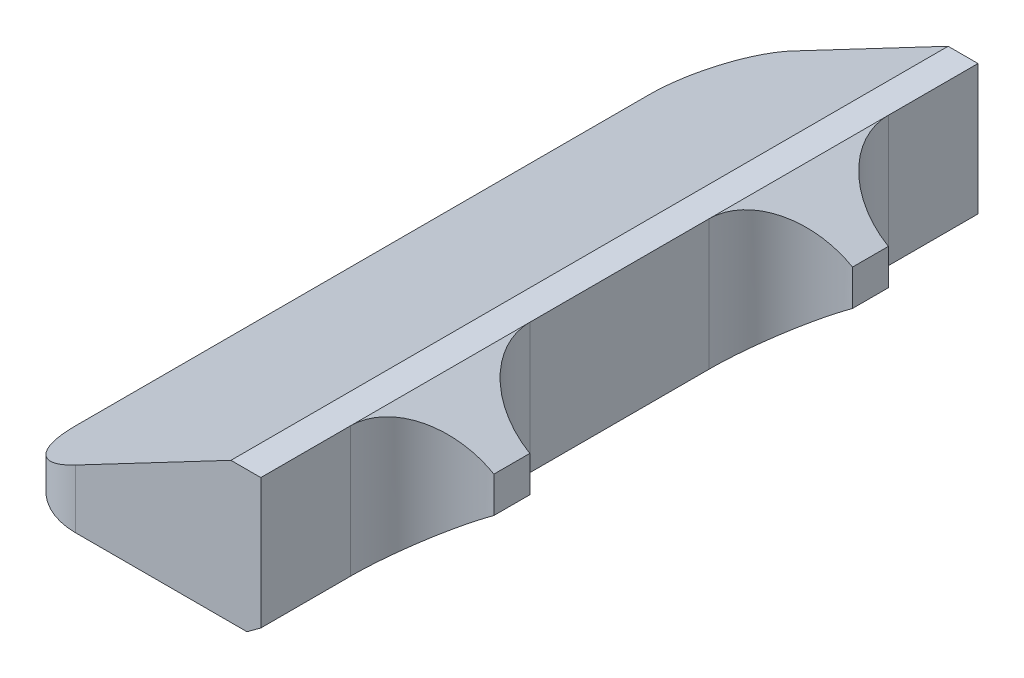
ISO-10303-21;
HEADER;
FILE_DESCRIPTION(('STEP AP214'),'2;1');
FILE_NAME('part.step','',(''),(''),'','','');
FILE_SCHEMA(('AUTOMOTIVE_DESIGN { 1 0 10303 214 1 1 1 1 }'));
ENDSEC;
DATA;
#1=APPLICATION_CONTEXT('core data for automotive mechanical design processes');
#2=APPLICATION_PROTOCOL_DEFINITION('international standard','automotive_design',2000,#1);
#3=PRODUCT_CONTEXT('',#1,'mechanical');
#4=PRODUCT('Part','Part','',(#3));
#5=PRODUCT_RELATED_PRODUCT_CATEGORY('part','',(#4));
#6=PRODUCT_DEFINITION_FORMATION('','',#4);
#7=PRODUCT_DEFINITION_CONTEXT('part definition',#1,'design');
#8=PRODUCT_DEFINITION('design','',#6,#7);
#9=PRODUCT_DEFINITION_SHAPE('','',#8);
#10=(LENGTH_UNIT() NAMED_UNIT(*) SI_UNIT(.MILLI.,.METRE.));
#11=(NAMED_UNIT(*) PLANE_ANGLE_UNIT() SI_UNIT($,.RADIAN.));
#12=(NAMED_UNIT(*) SI_UNIT($,.STERADIAN.) SOLID_ANGLE_UNIT());
#13=UNCERTAINTY_MEASURE_WITH_UNIT(LENGTH_MEASURE(1.E-05),#10,'distance_accuracy_value','');
#14=(GEOMETRIC_REPRESENTATION_CONTEXT(3) GLOBAL_UNCERTAINTY_ASSIGNED_CONTEXT((#13)) GLOBAL_UNIT_ASSIGNED_CONTEXT((#10,
#11,#12)) REPRESENTATION_CONTEXT('',''));
#15=CARTESIAN_POINT('',(0.,0.,0.));
#16=DIRECTION('',(0.,0.,1.));
#17=DIRECTION('',(1.,0.,0.));
#18=AXIS2_PLACEMENT_3D('',#15,#16,#17);
#19=CARTESIAN_POINT('',(20.,0.,60.));
#20=DIRECTION('',(-0.591363663627517,0.806404995855705,0.));
#21=DIRECTION('',(-0.806404995855706,-0.591363663627517,0.));
#22=AXIS2_PLACEMENT_3D('',#19,#20,#21);
#23=PLANE('',#22);
#24=DIRECTION('',(0.,0.,-1.));
#25=VECTOR('',#24,1.);
#26=CARTESIAN_POINT('',(20.,0.,60.));
#27=LINE('',#26,#25);
#28=CARTESIAN_POINT('',(20.,0.,59.75));
#29=VERTEX_POINT('',#28);
#30=CARTESIAN_POINT('',(20.,0.,0.24999999999999));
#31=VERTEX_POINT('',#30);
#32=EDGE_CURVE('E214',#29,#31,#27,.T.);
#33=ORIENTED_EDGE('',*,*,#32,.T.);
#34=DIRECTION('',(-0.694117220074126,-0.509019294721026,0.509019294721012));
#35=VECTOR('',#34,1.);
#36=CARTESIAN_POINT('',(10.3640256959313,-7.06638115631702,7.31638115631682));
#37=LINE('',#36,#35);
#38=CARTESIAN_POINT('',(20.3409090909091,0.25,0.));
#39=VERTEX_POINT('',#38);
#40=EDGE_CURVE('E242',#31,#39,#37,.F.);
#41=ORIENTED_EDGE('',*,*,#40,.T.);
#42=DIRECTION('',(0.806404995855706,0.591363663627517,0.));
#43=VECTOR('',#42,1.);
#44=CARTESIAN_POINT('',(20.,0.,0.));
#45=LINE('',#44,#43);
#46=CARTESIAN_POINT('',(21.5,1.1,0.));
#47=VERTEX_POINT('',#46);
#48=EDGE_CURVE('E295',#39,#47,#45,.T.);
#49=ORIENTED_EDGE('',*,*,#48,.T.);
#50=DIRECTION('',(0.,0.,-1.));
#51=VECTOR('',#50,1.);
#52=CARTESIAN_POINT('',(21.5,1.10000000000004,60.));
#53=LINE('',#52,#51);
#54=CARTESIAN_POINT('',(21.5,1.1,7.5));
#55=VERTEX_POINT('',#54);
#56=EDGE_CURVE('E353',#55,#47,#53,.T.);
#57=ORIENTED_EDGE('',*,*,#56,.F.);
#58=CARTESIAN_POINT('',(27.5,5.5,7.49999999999999));
#59=DIRECTION('',(-0.591363663627517,0.806404995855705,0.));
#60=DIRECTION('',(-0.806404995855706,-0.591363663627517,0.));
#61=AXIS2_PLACEMENT_3D('',#58,#59,#60);
#62=ELLIPSE('',#61,7.44043009509531,6.);
#63=CARTESIAN_POINT('',(27.5,5.5,13.5));
#64=VERTEX_POINT('',#63);
#65=EDGE_CURVE('E290',#64,#55,#62,.F.);
#66=ORIENTED_EDGE('',*,*,#65,.F.);
#67=DIRECTION('',(0.,0.,-1.));
#68=VECTOR('',#67,1.);
#69=CARTESIAN_POINT('',(27.5,5.5,60.));
#70=LINE('',#69,#68);
#71=CARTESIAN_POINT('',(27.5,5.5,16.5));
#72=VERTEX_POINT('',#71);
#73=EDGE_CURVE('E210',#72,#64,#70,.T.);
#74=ORIENTED_EDGE('',*,*,#73,.F.);
#75=CARTESIAN_POINT('',(27.5,5.5,22.5));
#76=DIRECTION('',(-0.591363663627517,0.806404995855705,0.));
#77=DIRECTION('',(-0.806404995855706,-0.591363663627517,0.));
#78=AXIS2_PLACEMENT_3D('',#75,#76,#77);
#79=ELLIPSE('',#78,7.44043009509531,6.);
#80=CARTESIAN_POINT('',(21.5,1.1,22.5));
#81=VERTEX_POINT('',#80);
#82=EDGE_CURVE('E364',#81,#72,#79,.F.);
#83=ORIENTED_EDGE('',*,*,#82,.F.);
#84=DIRECTION('',(0.,0.,-1.));
#85=VECTOR('',#84,1.);
#86=CARTESIAN_POINT('',(21.5,1.1,60.));
#87=LINE('',#86,#85);
#88=CARTESIAN_POINT('',(21.5,1.1,37.5));
#89=VERTEX_POINT('',#88);
#90=EDGE_CURVE('E360',#89,#81,#87,.T.);
#91=ORIENTED_EDGE('',*,*,#90,.F.);
#92=CARTESIAN_POINT('',(27.5,5.5,37.5));
#93=DIRECTION('',(-0.591363663627517,0.806404995855705,0.));
#94=DIRECTION('',(-0.806404995855706,-0.591363663627517,0.));
#95=AXIS2_PLACEMENT_3D('',#92,#93,#94);
#96=ELLIPSE('',#95,7.4404300950953,5.99999999999999);
#97=CARTESIAN_POINT('',(27.5,5.5,43.5));
#98=VERTEX_POINT('',#97);
#99=EDGE_CURVE('E184',#98,#89,#96,.F.);
#100=ORIENTED_EDGE('',*,*,#99,.F.);
#101=CARTESIAN_POINT('',(27.5,5.5,46.5));
#102=VERTEX_POINT('',#101);
#103=EDGE_CURVE('E213',#102,#98,#70,.T.);
#104=ORIENTED_EDGE('',*,*,#103,.F.);
#105=CARTESIAN_POINT('',(27.5,5.5,52.5));
#106=DIRECTION('',(-0.591363663627517,0.806404995855705,0.));
#107=DIRECTION('',(-0.806404995855706,-0.591363663627517,0.));
#108=AXIS2_PLACEMENT_3D('',#105,#106,#107);
#109=ELLIPSE('',#108,7.44043009509531,6.);
#110=CARTESIAN_POINT('',(21.5,1.1,52.5));
#111=VERTEX_POINT('',#110);
#112=EDGE_CURVE('E196',#111,#102,#109,.F.);
#113=ORIENTED_EDGE('',*,*,#112,.F.);
#114=DIRECTION('',(0.,0.,-1.));
#115=VECTOR('',#114,1.);
#116=CARTESIAN_POINT('',(21.5,1.1,60.));
#117=LINE('',#116,#115);
#118=CARTESIAN_POINT('',(21.5,1.1,60.));
#119=VERTEX_POINT('',#118);
#120=EDGE_CURVE('E280',#119,#111,#117,.T.);
#121=ORIENTED_EDGE('',*,*,#120,.F.);
#122=DIRECTION('',(0.806404995855706,0.591363663627517,0.));
#123=VECTOR('',#122,1.);
#124=CARTESIAN_POINT('',(20.,0.,60.));
#125=LINE('',#124,#123);
#126=CARTESIAN_POINT('',(20.3409090909091,0.249999999999994,60.));
#127=VERTEX_POINT('',#126);
#128=EDGE_CURVE('E273',#127,#119,#125,.T.);
#129=ORIENTED_EDGE('',*,*,#128,.F.);
#130=DIRECTION('',(-0.694117220074126,-0.509019294721026,-0.509019294721012));
#131=VECTOR('',#130,1.);
#132=CARTESIAN_POINT('',(10.5406852248393,-6.93683083511788,52.8131691648823));
#133=LINE('',#132,#131);
#134=EDGE_CURVE('E240',#127,#29,#133,.T.);
#135=ORIENTED_EDGE('',*,*,#134,.T.);
#136=EDGE_LOOP('',(#33,#41,#49,#57,#66,#74,#83,#91,#100,#104,#113,#121,#129,#135));
#137=FACE_BOUND('',#136,.T.);
#138=ADVANCED_FACE('F32',(#137),#23,.F.);
#139=CARTESIAN_POINT('',(27.5,5.5,60.));
#140=DIRECTION('',(-1.,0.,0.));
#141=DIRECTION('',(0.,0.,1.));
#142=AXIS2_PLACEMENT_3D('',#139,#140,#141);
#143=PLANE('',#142);
#144=DIRECTION('',(0.,-1.,0.));
#145=VECTOR('',#144,1.);
#146=CARTESIAN_POINT('',(27.5,12.,13.5));
#147=LINE('',#146,#145);
#148=CARTESIAN_POINT('',(27.5,8.5,13.5));
#149=VERTEX_POINT('',#148);
#150=EDGE_CURVE('E351',#149,#64,#147,.T.);
#151=ORIENTED_EDGE('',*,*,#150,.F.);
#152=DIRECTION('',(0.,0.,-1.));
#153=VECTOR('',#152,1.);
#154=CARTESIAN_POINT('',(27.5,8.5,60.));
#155=LINE('',#154,#153);
#156=CARTESIAN_POINT('',(27.5,8.5,16.5));
#157=VERTEX_POINT('',#156);
#158=EDGE_CURVE('E203',#157,#149,#155,.T.);
#159=ORIENTED_EDGE('',*,*,#158,.F.);
#160=DIRECTION('',(0.,-1.,0.));
#161=VECTOR('',#160,1.);
#162=CARTESIAN_POINT('',(27.5,12.,16.5));
#163=LINE('',#162,#161);
#164=EDGE_CURVE('E348',#157,#72,#163,.T.);
#165=ORIENTED_EDGE('',*,*,#164,.T.);
#166=ORIENTED_EDGE('',*,*,#73,.T.);
#167=EDGE_LOOP('',(#151,#159,#165,#166));
#168=FACE_BOUND('',#167,.T.);
#169=ADVANCED_FACE('F380',(#168),#143,.F.);
#170=DIRECTION('',(0.,-1.,0.));
#171=VECTOR('',#170,1.);
#172=CARTESIAN_POINT('',(27.5,12.,43.5));
#173=LINE('',#172,#171);
#174=CARTESIAN_POINT('',(27.5,8.5,43.5));
#175=VERTEX_POINT('',#174);
#176=EDGE_CURVE('E185',#175,#98,#173,.T.);
#177=ORIENTED_EDGE('',*,*,#176,.F.);
#178=CARTESIAN_POINT('',(27.5,8.5,46.5));
#179=VERTEX_POINT('',#178);
#180=EDGE_CURVE('E195',#179,#175,#155,.T.);
#181=ORIENTED_EDGE('',*,*,#180,.F.);
#182=DIRECTION('',(0.,-1.,0.));
#183=VECTOR('',#182,1.);
#184=CARTESIAN_POINT('',(27.5,12.,46.5));
#185=LINE('',#184,#183);
#186=EDGE_CURVE('E343',#179,#102,#185,.T.);
#187=ORIENTED_EDGE('',*,*,#186,.T.);
#188=ORIENTED_EDGE('',*,*,#103,.T.);
#189=EDGE_LOOP('',(#177,#181,#187,#188));
#190=FACE_BOUND('',#189,.T.);
#191=ADVANCED_FACE('F401',(#190),#143,.F.);
#192=CARTESIAN_POINT('',(21.5,12.,60.));
#193=DIRECTION('',(-0.503871025524086,-0.863778900898434,0.));
#194=DIRECTION('',(0.863778900898434,-0.503871025524086,0.));
#195=AXIS2_PLACEMENT_3D('',#192,#193,#194);
#196=PLANE('',#195);
#197=CARTESIAN_POINT('',(27.5,8.5,7.49999999999999));
#198=DIRECTION('',(-0.503871025524086,-0.863778900898434,0.));
#199=DIRECTION('',(0.863778900898434,-0.503871025524086,0.));
#200=AXIS2_PLACEMENT_3D('',#197,#198,#199);
#201=ELLIPSE('',#200,6.9462219947249,6.);
#202=CARTESIAN_POINT('',(21.5,12.,7.5));
#203=VERTEX_POINT('',#202);
#204=EDGE_CURVE('E365',#203,#149,#201,.F.);
#205=ORIENTED_EDGE('',*,*,#204,.F.);
#206=DIRECTION('',(0.,0.,-1.));
#207=VECTOR('',#206,1.);
#208=CARTESIAN_POINT('',(21.5,12.,60.));
#209=LINE('',#208,#207);
#210=CARTESIAN_POINT('',(21.5,12.,22.5));
#211=VERTEX_POINT('',#210);
#212=EDGE_CURVE('E201',#211,#203,#209,.T.);
#213=ORIENTED_EDGE('',*,*,#212,.F.);
#214=CARTESIAN_POINT('',(27.5,8.5,22.5));
#215=DIRECTION('',(-0.503871025524086,-0.863778900898434,0.));
#216=DIRECTION('',(0.863778900898434,-0.503871025524086,0.));
#217=AXIS2_PLACEMENT_3D('',#214,#215,#216);
#218=ELLIPSE('',#217,6.9462219947249,6.);
#219=EDGE_CURVE('E362',#157,#211,#218,.F.);
#220=ORIENTED_EDGE('',*,*,#219,.F.);
#221=ORIENTED_EDGE('',*,*,#158,.T.);
#222=EDGE_LOOP('',(#205,#213,#220,#221));
#223=FACE_BOUND('',#222,.T.);
#224=ADVANCED_FACE('F377',(#223),#196,.F.);
#225=CARTESIAN_POINT('',(27.5,8.5,37.5));
#226=DIRECTION('',(-0.503871025524086,-0.863778900898434,0.));
#227=DIRECTION('',(0.863778900898434,-0.503871025524086,0.));
#228=AXIS2_PLACEMENT_3D('',#225,#226,#227);
#229=ELLIPSE('',#228,6.94622199472489,5.99999999999999);
#230=CARTESIAN_POINT('',(21.5,12.,37.5));
#231=VERTEX_POINT('',#230);
#232=EDGE_CURVE('E181',#231,#175,#229,.F.);
#233=ORIENTED_EDGE('',*,*,#232,.F.);
#234=CARTESIAN_POINT('',(21.5,12.,52.5));
#235=VERTEX_POINT('',#234);
#236=EDGE_CURVE('E192',#235,#231,#209,.T.);
#237=ORIENTED_EDGE('',*,*,#236,.F.);
#238=CARTESIAN_POINT('',(27.5,8.5,52.5));
#239=DIRECTION('',(-0.503871025524086,-0.863778900898434,0.));
#240=DIRECTION('',(0.863778900898434,-0.503871025524086,0.));
#241=AXIS2_PLACEMENT_3D('',#238,#239,#240);
#242=ELLIPSE('',#241,6.9462219947249,6.);
#243=EDGE_CURVE('E356',#179,#235,#242,.F.);
#244=ORIENTED_EDGE('',*,*,#243,.F.);
#245=ORIENTED_EDGE('',*,*,#180,.T.);
#246=EDGE_LOOP('',(#233,#237,#244,#245));
#247=FACE_BOUND('',#246,.T.);
#248=ADVANCED_FACE('F190',(#247),#196,.F.);
#249=CARTESIAN_POINT('',(0.,0.,60.));
#250=DIRECTION('',(0.,0.,1.));
#251=DIRECTION('',(1.,0.,0.));
#252=AXIS2_PLACEMENT_3D('',#249,#250,#251);
#253=PLANE('',#252);
#254=DIRECTION('',(0.,-1.,0.));
#255=VECTOR('',#254,1.);
#256=CARTESIAN_POINT('',(6.,0.,60.));
#257=LINE('',#256,#255);
#258=CARTESIAN_POINT('',(6.,5.15789473684211,60.));
#259=VERTEX_POINT('',#258);
#260=CARTESIAN_POINT('',(6.,0.25,60.));
#261=VERTEX_POINT('',#260);
#262=EDGE_CURVE('E227',#259,#261,#257,.T.);
#263=ORIENTED_EDGE('',*,*,#262,.T.);
#264=DIRECTION('',(1.,0.,0.));
#265=VECTOR('',#264,1.);
#266=CARTESIAN_POINT('',(20.,0.25,60.));
#267=LINE('',#266,#265);
#268=EDGE_CURVE('E11',#261,#127,#267,.T.);
#269=ORIENTED_EDGE('',*,*,#268,.T.);
#270=ORIENTED_EDGE('',*,*,#128,.T.);
#271=DIRECTION('',(0.,-1.,0.));
#272=VECTOR('',#271,1.);
#273=CARTESIAN_POINT('',(21.5,12.,60.));
#274=LINE('',#273,#272);
#275=CARTESIAN_POINT('',(21.5,12.,60.));
#276=VERTEX_POINT('',#275);
#277=EDGE_CURVE('E332',#276,#119,#274,.T.);
#278=ORIENTED_EDGE('',*,*,#277,.F.);
#279=DIRECTION('',(-1.,0.,0.));
#280=VECTOR('',#279,1.);
#281=CARTESIAN_POINT('',(19.,12.,60.));
#282=LINE('',#281,#280);
#283=CARTESIAN_POINT('',(19.,12.,60.));
#284=VERTEX_POINT('',#283);
#285=EDGE_CURVE('E281',#276,#284,#282,.T.);
#286=ORIENTED_EDGE('',*,*,#285,.T.);
#287=DIRECTION('',(-0.884918222381982,-0.465746432832622,0.));
#288=VECTOR('',#287,1.);
#289=CARTESIAN_POINT('',(19.,12.,60.));
#290=LINE('',#289,#288);
#291=EDGE_CURVE('E284',#284,#259,#290,.T.);
#292=ORIENTED_EDGE('',*,*,#291,.T.);
#293=EDGE_LOOP('',(#263,#269,#270,#278,#286,#292));
#294=FACE_BOUND('',#293,.T.);
#295=ADVANCED_FACE('F271',(#294),#253,.T.);
#296=CARTESIAN_POINT('',(0.,0.,0.));
#297=DIRECTION('',(0.,0.,1.));
#298=DIRECTION('',(1.,0.,0.));
#299=AXIS2_PLACEMENT_3D('',#296,#297,#298);
#300=PLANE('',#299);
#301=ORIENTED_EDGE('',*,*,#48,.F.);
#302=DIRECTION('',(-1.,0.,0.));
#303=VECTOR('',#302,1.);
#304=CARTESIAN_POINT('',(0.,0.25,0.));
#305=LINE('',#304,#303);
#306=CARTESIAN_POINT('',(6.,0.25,0.));
#307=VERTEX_POINT('',#306);
#308=EDGE_CURVE('E244',#39,#307,#305,.T.);
#309=ORIENTED_EDGE('',*,*,#308,.T.);
#310=DIRECTION('',(0.,-1.,0.));
#311=VECTOR('',#310,1.);
#312=CARTESIAN_POINT('',(6.,0.,0.));
#313=LINE('',#312,#311);
#314=CARTESIAN_POINT('',(6.,5.15789473684211,0.));
#315=VERTEX_POINT('',#314);
#316=EDGE_CURVE('E221',#307,#315,#313,.F.);
#317=ORIENTED_EDGE('',*,*,#316,.T.);
#318=DIRECTION('',(-0.884918222381982,-0.465746432832622,0.));
#319=VECTOR('',#318,1.);
#320=CARTESIAN_POINT('',(19.,12.,0.));
#321=LINE('',#320,#319);
#322=CARTESIAN_POINT('',(19.,12.,0.));
#323=VERTEX_POINT('',#322);
#324=EDGE_CURVE('E282',#323,#315,#321,.T.);
#325=ORIENTED_EDGE('',*,*,#324,.F.);
#326=DIRECTION('',(-1.,0.,0.));
#327=VECTOR('',#326,1.);
#328=CARTESIAN_POINT('',(19.,12.,0.));
#329=LINE('',#328,#327);
#330=CARTESIAN_POINT('',(21.5,12.,0.));
#331=VERTEX_POINT('',#330);
#332=EDGE_CURVE('E287',#331,#323,#329,.T.);
#333=ORIENTED_EDGE('',*,*,#332,.F.);
#334=DIRECTION('',(0.,-1.,0.));
#335=VECTOR('',#334,1.);
#336=CARTESIAN_POINT('',(21.5,12.,0.));
#337=LINE('',#336,#335);
#338=EDGE_CURVE('E329',#331,#47,#337,.T.);
#339=ORIENTED_EDGE('',*,*,#338,.T.);
#340=EDGE_LOOP('',(#301,#309,#317,#325,#333,#339));
#341=FACE_BOUND('',#340,.T.);
#342=ADVANCED_FACE('F310',(#341),#300,.F.);
#343=CARTESIAN_POINT('',(0.,2.,60.));
#344=DIRECTION('',(1.,0.,0.));
#345=DIRECTION('',(0.,1.,0.));
#346=AXIS2_PLACEMENT_3D('',#343,#344,#345);
#347=PLANE('',#346);
#348=DIRECTION('',(0.,-1.,0.));
#349=VECTOR('',#348,1.);
#350=CARTESIAN_POINT('',(0.,2.,6.));
#351=LINE('',#350,#349);
#352=CARTESIAN_POINT('',(0.,2.,6.));
#353=VERTEX_POINT('',#352);
#354=CARTESIAN_POINT('',(0.,0.25,6.));
#355=VERTEX_POINT('',#354);
#356=EDGE_CURVE('E219',#353,#355,#351,.T.);
#357=ORIENTED_EDGE('',*,*,#356,.T.);
#358=DIRECTION('',(0.,0.,1.));
#359=VECTOR('',#358,1.);
#360=CARTESIAN_POINT('',(0.,0.25,60.));
#361=LINE('',#360,#359);
#362=CARTESIAN_POINT('',(0.,0.25,54.));
#363=VERTEX_POINT('',#362);
#364=EDGE_CURVE('E56',#355,#363,#361,.T.);
#365=ORIENTED_EDGE('',*,*,#364,.T.);
#366=DIRECTION('',(0.,-1.,0.));
#367=VECTOR('',#366,1.);
#368=CARTESIAN_POINT('',(0.,2.,54.));
#369=LINE('',#368,#367);
#370=CARTESIAN_POINT('',(0.,2.,54.));
#371=VERTEX_POINT('',#370);
#372=EDGE_CURVE('E217',#363,#371,#369,.F.);
#373=ORIENTED_EDGE('',*,*,#372,.T.);
#374=DIRECTION('',(0.,0.,-1.));
#375=VECTOR('',#374,1.);
#376=CARTESIAN_POINT('',(0.,2.,60.));
#377=LINE('',#376,#375);
#378=EDGE_CURVE('E294',#371,#353,#377,.T.);
#379=ORIENTED_EDGE('',*,*,#378,.T.);
#380=EDGE_LOOP('',(#357,#365,#373,#379));
#381=FACE_BOUND('',#380,.T.);
#382=ADVANCED_FACE('F407',(#381),#347,.F.);
#383=CARTESIAN_POINT('',(0.,0.,60.));
#384=DIRECTION('',(0.,1.,0.));
#385=DIRECTION('',(0.,0.,1.));
#386=AXIS2_PLACEMENT_3D('',#383,#384,#385);
#387=PLANE('',#386);
#388=CARTESIAN_POINT('',(6.,0.,6.));
#389=DIRECTION('',(0.,1.,0.));
#390=DIRECTION('',(0.,0.,1.));
#391=AXIS2_PLACEMENT_3D('',#388,#389,#390);
#392=CIRCLE('',#391,5.75000000000001);
#393=CARTESIAN_POINT('',(0.249999999999993,0.,6.));
#394=VERTEX_POINT('',#393);
#395=CARTESIAN_POINT('',(6.,0.,0.249999999999992));
#396=VERTEX_POINT('',#395);
#397=EDGE_CURVE('E235',#394,#396,#392,.F.);
#398=ORIENTED_EDGE('',*,*,#397,.T.);
#399=DIRECTION('',(1.,0.,0.));
#400=VECTOR('',#399,1.);
#401=CARTESIAN_POINT('',(0.,0.,0.249999999999993));
#402=LINE('',#401,#400);
#403=EDGE_CURVE('E237',#396,#31,#402,.T.);
#404=ORIENTED_EDGE('',*,*,#403,.T.);
#405=ORIENTED_EDGE('',*,*,#32,.F.);
#406=DIRECTION('',(-1.,0.,0.));
#407=VECTOR('',#406,1.);
#408=CARTESIAN_POINT('',(6.,0.,59.75));
#409=LINE('',#408,#407);
#410=CARTESIAN_POINT('',(6.,0.,59.75));
#411=VERTEX_POINT('',#410);
#412=EDGE_CURVE('E229',#29,#411,#409,.T.);
#413=ORIENTED_EDGE('',*,*,#412,.T.);
#414=CARTESIAN_POINT('',(6.,0.,54.));
#415=DIRECTION('',(0.,1.,0.));
#416=DIRECTION('',(0.,0.,1.));
#417=AXIS2_PLACEMENT_3D('',#414,#415,#416);
#418=CIRCLE('',#417,5.75000000000001);
#419=CARTESIAN_POINT('',(0.249999999999993,0.,54.));
#420=VERTEX_POINT('',#419);
#421=EDGE_CURVE('E231',#411,#420,#418,.F.);
#422=ORIENTED_EDGE('',*,*,#421,.T.);
#423=DIRECTION('',(0.,0.,-1.));
#424=VECTOR('',#423,1.);
#425=CARTESIAN_POINT('',(0.249999999999993,0.,60.));
#426=LINE('',#425,#424);
#427=EDGE_CURVE('E233',#420,#394,#426,.T.);
#428=ORIENTED_EDGE('',*,*,#427,.T.);
#429=EDGE_LOOP('',(#398,#404,#405,#413,#422,#428));
#430=FACE_BOUND('',#429,.T.);
#431=ADVANCED_FACE('F326',(#430),#387,.F.);
#432=CARTESIAN_POINT('',(19.,12.,60.));
#433=DIRECTION('',(0.,-1.,0.));
#434=DIRECTION('',(0.,0.,-1.));
#435=AXIS2_PLACEMENT_3D('',#432,#433,#434);
#436=PLANE('',#435);
#437=ORIENTED_EDGE('',*,*,#332,.T.);
#438=DIRECTION('',(0.,0.,-1.));
#439=VECTOR('',#438,1.);
#440=CARTESIAN_POINT('',(19.,12.,60.));
#441=LINE('',#440,#439);
#442=EDGE_CURVE('E204',#284,#323,#441,.T.);
#443=ORIENTED_EDGE('',*,*,#442,.F.);
#444=ORIENTED_EDGE('',*,*,#285,.F.);
#445=EDGE_CURVE('E200',#276,#235,#209,.T.);
#446=ORIENTED_EDGE('',*,*,#445,.T.);
#447=ORIENTED_EDGE('',*,*,#236,.T.);
#448=DIRECTION('',(0.,0.,1.));
#449=VECTOR('',#448,1.);
#450=CARTESIAN_POINT('',(21.5,12.,22.5));
#451=LINE('',#450,#449);
#452=EDGE_CURVE('E165',#211,#231,#451,.T.);
#453=ORIENTED_EDGE('',*,*,#452,.F.);
#454=ORIENTED_EDGE('',*,*,#212,.T.);
#455=DIRECTION('',(0.,0.,1.));
#456=VECTOR('',#455,1.);
#457=CARTESIAN_POINT('',(21.5,12.,0.));
#458=LINE('',#457,#456);
#459=EDGE_CURVE('E176',#331,#203,#458,.T.);
#460=ORIENTED_EDGE('',*,*,#459,.F.);
#461=EDGE_LOOP('',(#437,#443,#444,#446,#447,#453,#454,#460));
#462=FACE_BOUND('',#461,.T.);
#463=ADVANCED_FACE('F198',(#462),#436,.F.);
#464=CARTESIAN_POINT('',(19.,12.,60.));
#465=DIRECTION('',(0.465746432832622,-0.884918222381982,0.));
#466=DIRECTION('',(0.884918222381982,0.465746432832622,0.));
#467=AXIS2_PLACEMENT_3D('',#464,#465,#466);
#468=PLANE('',#467);
#469=ORIENTED_EDGE('',*,*,#324,.T.);
#470=CARTESIAN_POINT('',(6.,5.15789473684211,6.));
#471=DIRECTION('',(0.465746432832622,-0.884918222381982,0.));
#472=DIRECTION('',(-0.884918222381982,-0.465746432832622,0.));
#473=AXIS2_PLACEMENT_3D('',#470,#471,#472);
#474=ELLIPSE('',#473,6.78028754323702,6.);
#475=EDGE_CURVE('E225',#315,#353,#474,.F.);
#476=ORIENTED_EDGE('',*,*,#475,.T.);
#477=ORIENTED_EDGE('',*,*,#378,.F.);
#478=CARTESIAN_POINT('',(6.,5.15789473684211,54.));
#479=DIRECTION('',(0.465746432832622,-0.884918222381982,0.));
#480=DIRECTION('',(0.884918222381982,0.465746432832622,0.));
#481=AXIS2_PLACEMENT_3D('',#478,#479,#480);
#482=ELLIPSE('',#481,6.78028754323702,6.);
#483=EDGE_CURVE('E223',#371,#259,#482,.F.);
#484=ORIENTED_EDGE('',*,*,#483,.T.);
#485=ORIENTED_EDGE('',*,*,#291,.F.);
#486=ORIENTED_EDGE('',*,*,#442,.T.);
#487=EDGE_LOOP('',(#469,#476,#477,#484,#485,#486));
#488=FACE_BOUND('',#487,.T.);
#489=ADVANCED_FACE('F305',(#488),#468,.F.);
#490=CARTESIAN_POINT('',(21.5,12.,0.));
#491=DIRECTION('',(1.,0.,0.));
#492=DIRECTION('',(0.,0.,-1.));
#493=AXIS2_PLACEMENT_3D('',#490,#491,#492);
#494=PLANE('',#493);
#495=ORIENTED_EDGE('',*,*,#56,.T.);
#496=ORIENTED_EDGE('',*,*,#338,.F.);
#497=ORIENTED_EDGE('',*,*,#459,.T.);
#498=DIRECTION('',(0.,-1.,0.));
#499=VECTOR('',#498,1.);
#500=CARTESIAN_POINT('',(21.5,12.,7.5));
#501=LINE('',#500,#499);
#502=EDGE_CURVE('E333',#203,#55,#501,.T.);
#503=ORIENTED_EDGE('',*,*,#502,.T.);
#504=EDGE_LOOP('',(#495,#496,#497,#503));
#505=FACE_BOUND('',#504,.T.);
#506=ADVANCED_FACE('F373',(#505),#494,.T.);
#507=CARTESIAN_POINT('',(27.5,12.,7.49999999999999));
#508=DIRECTION('',(0.,-1.,0.));
#509=DIRECTION('',(0.,0.,-1.));
#510=AXIS2_PLACEMENT_3D('',#507,#508,#509);
#511=CYLINDRICAL_SURFACE('',#510,6.);
#512=ORIENTED_EDGE('',*,*,#65,.T.);
#513=ORIENTED_EDGE('',*,*,#502,.F.);
#514=ORIENTED_EDGE('',*,*,#204,.T.);
#515=ORIENTED_EDGE('',*,*,#150,.T.);
#516=EDGE_LOOP('',(#512,#513,#514,#515));
#517=FACE_BOUND('',#516,.T.);
#518=ADVANCED_FACE('F371',(#517),#511,.F.);
#519=CARTESIAN_POINT('',(21.5,12.,52.5));
#520=DIRECTION('',(1.,0.,0.));
#521=DIRECTION('',(0.,0.,-1.));
#522=AXIS2_PLACEMENT_3D('',#519,#520,#521);
#523=PLANE('',#522);
#524=ORIENTED_EDGE('',*,*,#120,.T.);
#525=DIRECTION('',(0.,-1.,0.));
#526=VECTOR('',#525,1.);
#527=CARTESIAN_POINT('',(21.5,12.,52.5));
#528=LINE('',#527,#526);
#529=EDGE_CURVE('E335',#235,#111,#528,.T.);
#530=ORIENTED_EDGE('',*,*,#529,.F.);
#531=ORIENTED_EDGE('',*,*,#445,.F.);
#532=ORIENTED_EDGE('',*,*,#277,.T.);
#533=EDGE_LOOP('',(#524,#530,#531,#532));
#534=FACE_BOUND('',#533,.T.);
#535=ADVANCED_FACE('F392',(#534),#523,.T.);
#536=CARTESIAN_POINT('',(27.5,12.,52.5));
#537=DIRECTION('',(0.,-1.,0.));
#538=DIRECTION('',(0.,0.,-1.));
#539=AXIS2_PLACEMENT_3D('',#536,#537,#538);
#540=CYLINDRICAL_SURFACE('',#539,6.);
#541=ORIENTED_EDGE('',*,*,#112,.T.);
#542=ORIENTED_EDGE('',*,*,#186,.F.);
#543=ORIENTED_EDGE('',*,*,#243,.T.);
#544=ORIENTED_EDGE('',*,*,#529,.T.);
#545=EDGE_LOOP('',(#541,#542,#543,#544));
#546=FACE_BOUND('',#545,.T.);
#547=ADVANCED_FACE('F385',(#546),#540,.F.);
#548=CARTESIAN_POINT('',(27.5,12.,22.5));
#549=DIRECTION('',(0.,-1.,0.));
#550=DIRECTION('',(0.,0.,-1.));
#551=AXIS2_PLACEMENT_3D('',#548,#549,#550);
#552=CYLINDRICAL_SURFACE('',#551,6.);
#553=ORIENTED_EDGE('',*,*,#82,.T.);
#554=ORIENTED_EDGE('',*,*,#164,.F.);
#555=ORIENTED_EDGE('',*,*,#219,.T.);
#556=DIRECTION('',(0.,-1.,0.));
#557=VECTOR('',#556,1.);
#558=CARTESIAN_POINT('',(21.5,12.,22.5));
#559=LINE('',#558,#557);
#560=EDGE_CURVE('E171',#211,#81,#559,.T.);
#561=ORIENTED_EDGE('',*,*,#560,.T.);
#562=EDGE_LOOP('',(#553,#554,#555,#561));
#563=FACE_BOUND('',#562,.T.);
#564=ADVANCED_FACE('F383',(#563),#552,.F.);
#565=CARTESIAN_POINT('',(21.5,12.,22.5));
#566=DIRECTION('',(1.,0.,0.));
#567=DIRECTION('',(0.,0.,-1.));
#568=AXIS2_PLACEMENT_3D('',#565,#566,#567);
#569=PLANE('',#568);
#570=ORIENTED_EDGE('',*,*,#90,.T.);
#571=ORIENTED_EDGE('',*,*,#560,.F.);
#572=ORIENTED_EDGE('',*,*,#452,.T.);
#573=DIRECTION('',(0.,-1.,0.));
#574=VECTOR('',#573,1.);
#575=CARTESIAN_POINT('',(21.5,12.,37.5));
#576=LINE('',#575,#574);
#577=EDGE_CURVE('E168',#231,#89,#576,.T.);
#578=ORIENTED_EDGE('',*,*,#577,.T.);
#579=EDGE_LOOP('',(#570,#571,#572,#578));
#580=FACE_BOUND('',#579,.T.);
#581=ADVANCED_FACE('F167',(#580),#569,.T.);
#582=CARTESIAN_POINT('',(27.5,12.,37.5));
#583=DIRECTION('',(0.,-1.,0.));
#584=DIRECTION('',(0.,0.,-1.));
#585=AXIS2_PLACEMENT_3D('',#582,#583,#584);
#586=CYLINDRICAL_SURFACE('',#585,5.99999999999999);
#587=ORIENTED_EDGE('',*,*,#99,.T.);
#588=ORIENTED_EDGE('',*,*,#577,.F.);
#589=ORIENTED_EDGE('',*,*,#232,.T.);
#590=ORIENTED_EDGE('',*,*,#176,.T.);
#591=EDGE_LOOP('',(#587,#588,#589,#590));
#592=FACE_BOUND('',#591,.T.);
#593=ADVANCED_FACE('F180',(#592),#586,.F.);
#594=CARTESIAN_POINT('',(6.,2.,6.));
#595=DIRECTION('',(0.,-1.,0.));
#596=DIRECTION('',(1.,0.,0.));
#597=AXIS2_PLACEMENT_3D('',#594,#595,#596);
#598=CYLINDRICAL_SURFACE('',#597,6.);
#599=ORIENTED_EDGE('',*,*,#316,.F.);
#600=CARTESIAN_POINT('',(6.,0.25,6.));
#601=DIRECTION('',(0.,1.,0.));
#602=DIRECTION('',(0.,0.,1.));
#603=AXIS2_PLACEMENT_3D('',#600,#601,#602);
#604=CIRCLE('',#603,6.);
#605=EDGE_CURVE('E246',#307,#355,#604,.T.);
#606=ORIENTED_EDGE('',*,*,#605,.T.);
#607=ORIENTED_EDGE('',*,*,#356,.F.);
#608=ORIENTED_EDGE('',*,*,#475,.F.);
#609=EDGE_LOOP('',(#599,#606,#607,#608));
#610=FACE_BOUND('',#609,.T.);
#611=ADVANCED_FACE('F316',(#610),#598,.T.);
#612=CARTESIAN_POINT('',(6.,0.,54.));
#613=DIRECTION('',(0.,1.,0.));
#614=DIRECTION('',(-1.,0.,0.));
#615=AXIS2_PLACEMENT_3D('',#612,#613,#614);
#616=CYLINDRICAL_SURFACE('',#615,6.);
#617=ORIENTED_EDGE('',*,*,#372,.F.);
#618=CARTESIAN_POINT('',(6.,0.25,54.));
#619=DIRECTION('',(0.,1.,0.));
#620=DIRECTION('',(0.,0.,1.));
#621=AXIS2_PLACEMENT_3D('',#618,#619,#620);
#622=CIRCLE('',#621,6.);
#623=EDGE_CURVE('E41',#363,#261,#622,.T.);
#624=ORIENTED_EDGE('',*,*,#623,.T.);
#625=ORIENTED_EDGE('',*,*,#262,.F.);
#626=ORIENTED_EDGE('',*,*,#483,.F.);
#627=EDGE_LOOP('',(#617,#624,#625,#626));
#628=FACE_BOUND('',#627,.T.);
#629=ADVANCED_FACE('F412',(#628),#616,.T.);
#630=CARTESIAN_POINT('',(0.,0.25,60.));
#631=DIRECTION('',(0.,-0.707106781186538,0.707106781186557));
#632=DIRECTION('',(0.,-0.707106781186557,-0.707106781186538));
#633=AXIS2_PLACEMENT_3D('',#630,#631,#632);
#634=PLANE('',#633);
#635=ORIENTED_EDGE('',*,*,#134,.F.);
#636=ORIENTED_EDGE('',*,*,#268,.F.);
#637=DIRECTION('',(0.,0.707106781186557,0.707106781186538));
#638=VECTOR('',#637,1.);
#639=CARTESIAN_POINT('',(6.,0.,59.75));
#640=LINE('',#639,#638);
#641=EDGE_CURVE('E36',#411,#261,#640,.T.);
#642=ORIENTED_EDGE('',*,*,#641,.F.);
#643=ORIENTED_EDGE('',*,*,#412,.F.);
#644=EDGE_LOOP('',(#635,#636,#642,#643));
#645=FACE_BOUND('',#644,.T.);
#646=ADVANCED_FACE('F34',(#645),#634,.T.);
#647=CARTESIAN_POINT('',(6.,0.,54.));
#648=DIRECTION('',(0.,1.,0.));
#649=DIRECTION('',(0.,0.,1.));
#650=AXIS2_PLACEMENT_3D('',#647,#648,#649);
#651=CONICAL_SURFACE('',#650,5.75000000000001,0.785398163397435);
#652=ORIENTED_EDGE('',*,*,#641,.T.);
#653=ORIENTED_EDGE('',*,*,#623,.F.);
#654=DIRECTION('',(-0.707106781186538,0.707106781186557,0.));
#655=VECTOR('',#654,1.);
#656=CARTESIAN_POINT('',(0.249999999999993,0.,54.));
#657=LINE('',#656,#655);
#658=EDGE_CURVE('E255',#420,#363,#657,.T.);
#659=ORIENTED_EDGE('',*,*,#658,.F.);
#660=ORIENTED_EDGE('',*,*,#421,.F.);
#661=EDGE_LOOP('',(#652,#653,#659,#660));
#662=FACE_BOUND('',#661,.T.);
#663=ADVANCED_FACE('F264',(#662),#651,.T.);
#664=CARTESIAN_POINT('',(0.249999999999993,0.,60.));
#665=DIRECTION('',(0.707106781186557,0.707106781186538,0.));
#666=DIRECTION('',(-0.707106781186538,0.707106781186557,0.));
#667=AXIS2_PLACEMENT_3D('',#664,#665,#666);
#668=PLANE('',#667);
#669=ORIENTED_EDGE('',*,*,#658,.T.);
#670=ORIENTED_EDGE('',*,*,#364,.F.);
#671=DIRECTION('',(-0.707106781186538,0.707106781186557,0.));
#672=VECTOR('',#671,1.);
#673=CARTESIAN_POINT('',(0.249999999999993,0.,6.));
#674=LINE('',#673,#672);
#675=EDGE_CURVE('E253',#394,#355,#674,.T.);
#676=ORIENTED_EDGE('',*,*,#675,.F.);
#677=ORIENTED_EDGE('',*,*,#427,.F.);
#678=EDGE_LOOP('',(#669,#670,#676,#677));
#679=FACE_BOUND('',#678,.T.);
#680=ADVANCED_FACE('F419',(#679),#668,.F.);
#681=CARTESIAN_POINT('',(6.,0.,6.));
#682=DIRECTION('',(0.,1.,0.));
#683=DIRECTION('',(0.,0.,1.));
#684=AXIS2_PLACEMENT_3D('',#681,#682,#683);
#685=CONICAL_SURFACE('',#684,5.75000000000001,0.785398163397435);
#686=ORIENTED_EDGE('',*,*,#675,.T.);
#687=ORIENTED_EDGE('',*,*,#605,.F.);
#688=DIRECTION('',(0.,0.707106781186557,-0.707106781186538));
#689=VECTOR('',#688,1.);
#690=CARTESIAN_POINT('',(6.,0.,0.249999999999992));
#691=LINE('',#690,#689);
#692=EDGE_CURVE('E250',#396,#307,#691,.T.);
#693=ORIENTED_EDGE('',*,*,#692,.F.);
#694=ORIENTED_EDGE('',*,*,#397,.F.);
#695=EDGE_LOOP('',(#686,#687,#693,#694));
#696=FACE_BOUND('',#695,.T.);
#697=ADVANCED_FACE('F319',(#696),#685,.T.);
#698=CARTESIAN_POINT('',(0.,0.,0.249999999999993));
#699=DIRECTION('',(0.,0.707106781186538,0.707106781186557));
#700=DIRECTION('',(0.,-0.707106781186557,0.707106781186538));
#701=AXIS2_PLACEMENT_3D('',#698,#699,#700);
#702=PLANE('',#701);
#703=ORIENTED_EDGE('',*,*,#692,.T.);
#704=ORIENTED_EDGE('',*,*,#308,.F.);
#705=ORIENTED_EDGE('',*,*,#40,.F.);
#706=ORIENTED_EDGE('',*,*,#403,.F.);
#707=EDGE_LOOP('',(#703,#704,#705,#706));
#708=FACE_BOUND('',#707,.T.);
#709=ADVANCED_FACE('F324',(#708),#702,.F.);
#710=CLOSED_SHELL('',(#138,#169,#191,#224,#248,#295,#342,#382,#431,#463,#489,#506,#518,#535,
#547,#564,#581,#593,#611,#629,#646,#663,#680,#697,#709));
#711=MANIFOLD_SOLID_BREP('B2',#710);
#712=ADVANCED_BREP_SHAPE_REPRESENTATION('',(#18,#711),#14);
#713=SHAPE_DEFINITION_REPRESENTATION(#9,#712);
ENDSEC;
END-ISO-10303-21;
